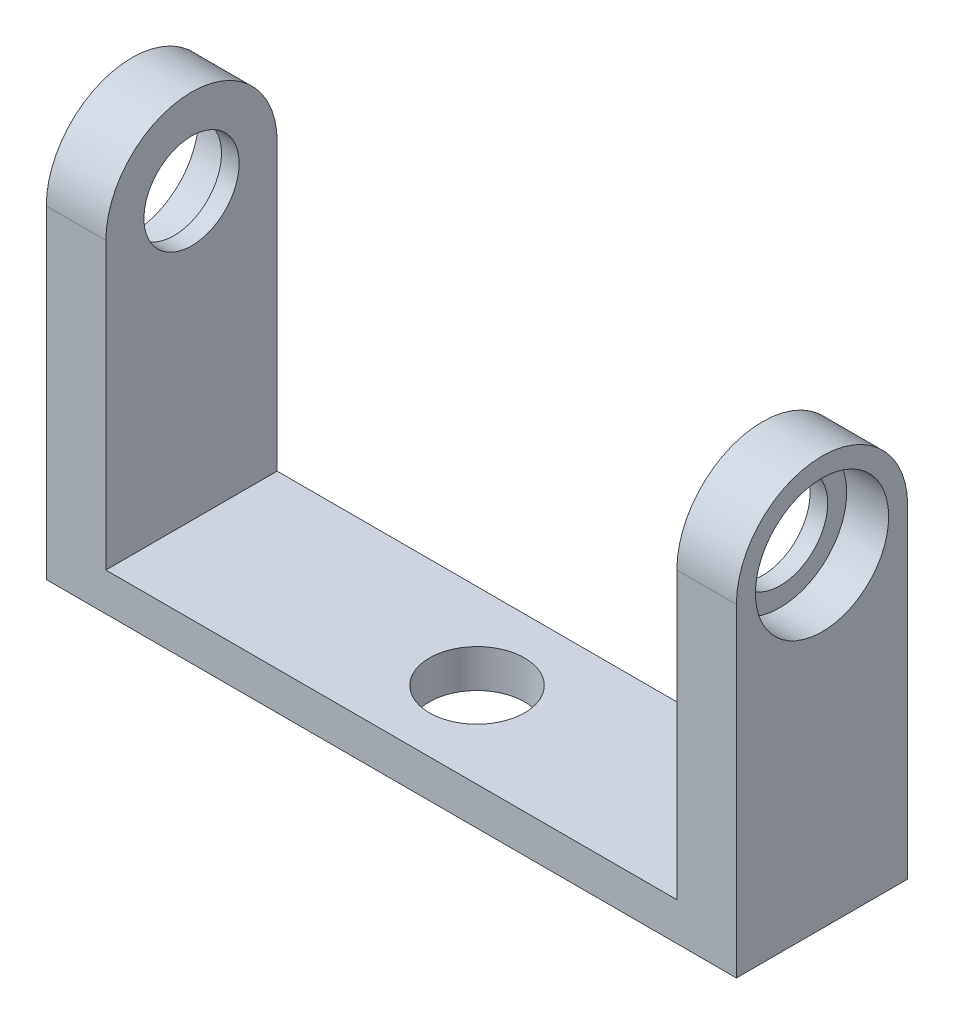
ISO-10303-21;
HEADER;
FILE_DESCRIPTION(('STEP AP214'),'2;1');
FILE_NAME('part.step','',(''),(''),'','','');
FILE_SCHEMA(('AUTOMOTIVE_DESIGN { 1 0 10303 214 1 1 1 1 }'));
ENDSEC;
DATA;
#1=APPLICATION_CONTEXT('core data for automotive mechanical design processes');
#2=APPLICATION_PROTOCOL_DEFINITION('international standard','automotive_design',2000,#1);
#3=PRODUCT_CONTEXT('',#1,'mechanical');
#4=PRODUCT('Part','Part','',(#3));
#5=PRODUCT_RELATED_PRODUCT_CATEGORY('part','',(#4));
#6=PRODUCT_DEFINITION_FORMATION('','',#4);
#7=PRODUCT_DEFINITION_CONTEXT('part definition',#1,'design');
#8=PRODUCT_DEFINITION('design','',#6,#7);
#9=PRODUCT_DEFINITION_SHAPE('','',#8);
#10=(LENGTH_UNIT() NAMED_UNIT(*) SI_UNIT(.MILLI.,.METRE.));
#11=(NAMED_UNIT(*) PLANE_ANGLE_UNIT() SI_UNIT($,.RADIAN.));
#12=(NAMED_UNIT(*) SI_UNIT($,.STERADIAN.) SOLID_ANGLE_UNIT());
#13=UNCERTAINTY_MEASURE_WITH_UNIT(LENGTH_MEASURE(1.E-05),#10,'distance_accuracy_value','');
#14=(GEOMETRIC_REPRESENTATION_CONTEXT(3) GLOBAL_UNCERTAINTY_ASSIGNED_CONTEXT((#13)) GLOBAL_UNIT_ASSIGNED_CONTEXT((#10,
#11,#12)) REPRESENTATION_CONTEXT('',''));
#15=CARTESIAN_POINT('',(0.,0.,0.));
#16=DIRECTION('',(0.,0.,1.));
#17=DIRECTION('',(1.,0.,0.));
#18=AXIS2_PLACEMENT_3D('',#15,#16,#17);
#19=CARTESIAN_POINT('',(6.26,0.,0.));
#20=DIRECTION('',(-1.,0.,0.));
#21=DIRECTION('',(0.,0.,1.));
#22=AXIS2_PLACEMENT_3D('',#19,#20,#21);
#23=CYLINDRICAL_SURFACE('',#22,5.);
#24=CARTESIAN_POINT('',(0.,0.,0.));
#25=DIRECTION('',(1.,0.,0.));
#26=DIRECTION('',(0.,0.,-1.));
#27=AXIS2_PLACEMENT_3D('',#24,#25,#26);
#28=CIRCLE('',#27,5.);
#29=CARTESIAN_POINT('',(0.,0.,-5.));
#30=VERTEX_POINT('',#29);
#31=EDGE_CURVE('E186',#30,#30,#28,.T.);
#32=ORIENTED_EDGE('',*,*,#31,.F.);
#33=EDGE_LOOP('',(#32));
#34=FACE_BOUND('',#33,.T.);
#35=CARTESIAN_POINT('',(1.85,0.,0.));
#36=DIRECTION('',(1.,0.,0.));
#37=DIRECTION('',(0.,0.,-1.));
#38=AXIS2_PLACEMENT_3D('',#35,#36,#37);
#39=CIRCLE('',#38,5.);
#40=CARTESIAN_POINT('',(1.85,0.,-5.));
#41=VERTEX_POINT('',#40);
#42=EDGE_CURVE('E37',#41,#41,#39,.T.);
#43=ORIENTED_EDGE('',*,*,#42,.T.);
#44=EDGE_LOOP('',(#43));
#45=FACE_BOUND('',#44,.T.);
#46=ADVANCED_FACE('F33',(#34,#45),#23,.F.);
#47=CARTESIAN_POINT('',(6.26,0.,0.));
#48=DIRECTION('',(1.,0.,0.));
#49=DIRECTION('',(0.,0.,-1.));
#50=AXIS2_PLACEMENT_3D('',#47,#48,#49);
#51=PLANE('',#50);
#52=CARTESIAN_POINT('',(6.26,0.,0.));
#53=DIRECTION('',(1.,0.,0.));
#54=DIRECTION('',(0.,0.,-1.));
#55=AXIS2_PLACEMENT_3D('',#52,#53,#54);
#56=CIRCLE('',#55,7.);
#57=CARTESIAN_POINT('',(6.26,0.,-7.));
#58=VERTEX_POINT('',#57);
#59=EDGE_CURVE('E169',#58,#58,#56,.T.);
#60=ORIENTED_EDGE('',*,*,#59,.F.);
#61=EDGE_LOOP('',(#60));
#62=FACE_BOUND('',#61,.T.);
#63=CARTESIAN_POINT('',(6.26,0.,0.));
#64=DIRECTION('',(1.,0.,0.));
#65=DIRECTION('',(0.,0.,-1.));
#66=AXIS2_PLACEMENT_3D('',#63,#64,#65);
#67=CIRCLE('',#66,9.);
#68=CARTESIAN_POINT('',(6.26,0.,-9.));
#69=VERTEX_POINT('',#68);
#70=CARTESIAN_POINT('',(6.26,0.,9.));
#71=VERTEX_POINT('',#70);
#72=EDGE_CURVE('E11',#69,#71,#67,.T.);
#73=ORIENTED_EDGE('',*,*,#72,.T.);
#74=DIRECTION('',(0.,1.,0.));
#75=VECTOR('',#74,1.);
#76=CARTESIAN_POINT('',(6.26,-30.,9.));
#77=LINE('',#76,#75);
#78=CARTESIAN_POINT('',(6.26,-34.,9.));
#79=VERTEX_POINT('',#78);
#80=EDGE_CURVE('E178',#79,#71,#77,.T.);
#81=ORIENTED_EDGE('',*,*,#80,.F.);
#82=DIRECTION('',(0.,0.,1.));
#83=VECTOR('',#82,1.);
#84=CARTESIAN_POINT('',(6.26,-34.,9.));
#85=LINE('',#84,#83);
#86=CARTESIAN_POINT('',(6.26,-34.,-9.));
#87=VERTEX_POINT('',#86);
#88=EDGE_CURVE('E115',#87,#79,#85,.T.);
#89=ORIENTED_EDGE('',*,*,#88,.F.);
#90=DIRECTION('',(0.,-1.,0.));
#91=VECTOR('',#90,1.);
#92=CARTESIAN_POINT('',(6.26,0.,-9.));
#93=LINE('',#92,#91);
#94=EDGE_CURVE('E71',#69,#87,#93,.T.);
#95=ORIENTED_EDGE('',*,*,#94,.F.);
#96=EDGE_LOOP('',(#73,#81,#89,#95));
#97=FACE_BOUND('',#96,.T.);
#98=ADVANCED_FACE('F199',(#62,#97),#51,.T.);
#99=CARTESIAN_POINT('',(0.,0.,0.));
#100=DIRECTION('',(1.,0.,0.));
#101=DIRECTION('',(0.,0.,-1.));
#102=AXIS2_PLACEMENT_3D('',#99,#100,#101);
#103=PLANE('',#102);
#104=DIRECTION('',(0.,1.,0.));
#105=VECTOR('',#104,1.);
#106=CARTESIAN_POINT('',(0.,-30.,9.));
#107=LINE('',#106,#105);
#108=CARTESIAN_POINT('',(0.,-30.,9.));
#109=VERTEX_POINT('',#108);
#110=CARTESIAN_POINT('',(0.,0.,9.));
#111=VERTEX_POINT('',#110);
#112=EDGE_CURVE('E179',#109,#111,#107,.T.);
#113=ORIENTED_EDGE('',*,*,#112,.T.);
#114=CARTESIAN_POINT('',(0.,0.,0.));
#115=DIRECTION('',(1.,0.,0.));
#116=DIRECTION('',(0.,0.,-1.));
#117=AXIS2_PLACEMENT_3D('',#114,#115,#116);
#118=CIRCLE('',#117,9.);
#119=CARTESIAN_POINT('',(0.,0.,-9.));
#120=VERTEX_POINT('',#119);
#121=EDGE_CURVE('E42',#120,#111,#118,.T.);
#122=ORIENTED_EDGE('',*,*,#121,.F.);
#123=DIRECTION('',(0.,-1.,0.));
#124=VECTOR('',#123,1.);
#125=CARTESIAN_POINT('',(0.,0.,-9.));
#126=LINE('',#125,#124);
#127=CARTESIAN_POINT('',(0.,-30.,-9.));
#128=VERTEX_POINT('',#127);
#129=EDGE_CURVE('E50',#120,#128,#126,.T.);
#130=ORIENTED_EDGE('',*,*,#129,.T.);
#131=DIRECTION('',(0.,0.,1.));
#132=VECTOR('',#131,1.);
#133=CARTESIAN_POINT('',(0.,-30.,-8.99999999999999));
#134=LINE('',#133,#132);
#135=EDGE_CURVE('E77',#128,#109,#134,.T.);
#136=ORIENTED_EDGE('',*,*,#135,.T.);
#137=EDGE_LOOP('',(#113,#122,#130,#136));
#138=FACE_BOUND('',#137,.T.);
#139=ORIENTED_EDGE('',*,*,#31,.T.);
#140=EDGE_LOOP('',(#139));
#141=FACE_BOUND('',#140,.T.);
#142=ADVANCED_FACE('F197',(#138,#141),#103,.F.);
#143=CARTESIAN_POINT('',(6.26,0.,0.));
#144=DIRECTION('',(-1.,0.,0.));
#145=DIRECTION('',(0.,0.,1.));
#146=AXIS2_PLACEMENT_3D('',#143,#144,#145);
#147=CYLINDRICAL_SURFACE('',#146,9.);
#148=ORIENTED_EDGE('',*,*,#121,.T.);
#149=DIRECTION('',(-1.,0.,0.));
#150=VECTOR('',#149,1.);
#151=CARTESIAN_POINT('',(41.2457113690718,0.,9.));
#152=LINE('',#151,#150);
#153=EDGE_CURVE('E184',#71,#111,#152,.T.);
#154=ORIENTED_EDGE('',*,*,#153,.F.);
#155=ORIENTED_EDGE('',*,*,#72,.F.);
#156=DIRECTION('',(-1.,0.,0.));
#157=VECTOR('',#156,1.);
#158=CARTESIAN_POINT('',(41.2457113690718,0.,-9.));
#159=LINE('',#158,#157);
#160=EDGE_CURVE('E187',#69,#120,#159,.T.);
#161=ORIENTED_EDGE('',*,*,#160,.T.);
#162=EDGE_LOOP('',(#148,#154,#155,#161));
#163=FACE_BOUND('',#162,.T.);
#164=ADVANCED_FACE('F35',(#163),#147,.T.);
#165=CARTESIAN_POINT('',(41.2457113690718,-30.,9.));
#166=DIRECTION('',(0.,0.,1.));
#167=DIRECTION('',(0.,-1.,0.));
#168=AXIS2_PLACEMENT_3D('',#165,#166,#167);
#169=PLANE('',#168);
#170=ORIENTED_EDGE('',*,*,#112,.F.);
#171=DIRECTION('',(-1.,0.,0.));
#172=VECTOR('',#171,1.);
#173=CARTESIAN_POINT('',(6.26,-30.,9.));
#174=LINE('',#173,#172);
#175=CARTESIAN_POINT('',(-60.,-30.,9.00000000000001));
#176=VERTEX_POINT('',#175);
#177=EDGE_CURVE('E59',#109,#176,#174,.T.);
#178=ORIENTED_EDGE('',*,*,#177,.T.);
#179=DIRECTION('',(0.,1.,0.));
#180=VECTOR('',#179,1.);
#181=CARTESIAN_POINT('',(-60.,-30.,9.00000000000001));
#182=LINE('',#181,#180);
#183=CARTESIAN_POINT('',(-60.,0.,9.00000000000001));
#184=VERTEX_POINT('',#183);
#185=EDGE_CURVE('E148',#176,#184,#182,.T.);
#186=ORIENTED_EDGE('',*,*,#185,.T.);
#187=DIRECTION('',(1.,0.,0.));
#188=VECTOR('',#187,1.);
#189=CARTESIAN_POINT('',(-101.245711369072,0.,9.00000000000003));
#190=LINE('',#189,#188);
#191=CARTESIAN_POINT('',(-66.26,0.,9.00000000000001));
#192=VERTEX_POINT('',#191);
#193=EDGE_CURVE('E123',#192,#184,#190,.T.);
#194=ORIENTED_EDGE('',*,*,#193,.F.);
#195=DIRECTION('',(0.,1.,0.));
#196=VECTOR('',#195,1.);
#197=CARTESIAN_POINT('',(-66.26,-30.,9.00000000000001));
#198=LINE('',#197,#196);
#199=CARTESIAN_POINT('',(-66.26,-34.,9.00000000000001));
#200=VERTEX_POINT('',#199);
#201=EDGE_CURVE('E120',#200,#192,#198,.T.);
#202=ORIENTED_EDGE('',*,*,#201,.F.);
#203=DIRECTION('',(-1.,0.,0.));
#204=VECTOR('',#203,1.);
#205=CARTESIAN_POINT('',(6.26,-34.,9.));
#206=LINE('',#205,#204);
#207=EDGE_CURVE('E108',#79,#200,#206,.T.);
#208=ORIENTED_EDGE('',*,*,#207,.F.);
#209=ORIENTED_EDGE('',*,*,#80,.T.);
#210=ORIENTED_EDGE('',*,*,#153,.T.);
#211=EDGE_LOOP('',(#170,#178,#186,#194,#202,#208,#209,#210));
#212=FACE_BOUND('',#211,.T.);
#213=ADVANCED_FACE('F121',(#212),#169,.T.);
#214=CARTESIAN_POINT('',(41.2457113690718,0.,-9.));
#215=DIRECTION('',(0.,0.,-1.));
#216=DIRECTION('',(0.,1.,0.));
#217=AXIS2_PLACEMENT_3D('',#214,#215,#216);
#218=PLANE('',#217);
#219=ORIENTED_EDGE('',*,*,#160,.F.);
#220=ORIENTED_EDGE('',*,*,#94,.T.);
#221=DIRECTION('',(1.,0.,0.));
#222=VECTOR('',#221,1.);
#223=CARTESIAN_POINT('',(6.26,-34.,-9.));
#224=LINE('',#223,#222);
#225=CARTESIAN_POINT('',(-66.26,-34.,-8.99999999999998));
#226=VERTEX_POINT('',#225);
#227=EDGE_CURVE('E117',#226,#87,#224,.T.);
#228=ORIENTED_EDGE('',*,*,#227,.F.);
#229=DIRECTION('',(0.,-1.,0.));
#230=VECTOR('',#229,1.);
#231=CARTESIAN_POINT('',(-66.26,0.,-8.99999999999999));
#232=LINE('',#231,#230);
#233=CARTESIAN_POINT('',(-66.26,0.,-8.99999999999999));
#234=VERTEX_POINT('',#233);
#235=EDGE_CURVE('E131',#234,#226,#232,.T.);
#236=ORIENTED_EDGE('',*,*,#235,.F.);
#237=DIRECTION('',(1.,0.,0.));
#238=VECTOR('',#237,1.);
#239=CARTESIAN_POINT('',(-101.245711369072,0.,-8.99999999999997));
#240=LINE('',#239,#238);
#241=CARTESIAN_POINT('',(-60.,0.,-8.99999999999999));
#242=VERTEX_POINT('',#241);
#243=EDGE_CURVE('E154',#234,#242,#240,.T.);
#244=ORIENTED_EDGE('',*,*,#243,.T.);
#245=DIRECTION('',(0.,-1.,0.));
#246=VECTOR('',#245,1.);
#247=CARTESIAN_POINT('',(-60.,0.,-8.99999999999999));
#248=LINE('',#247,#246);
#249=CARTESIAN_POINT('',(-60.,-30.,-8.99999999999998));
#250=VERTEX_POINT('',#249);
#251=EDGE_CURVE('E127',#242,#250,#248,.T.);
#252=ORIENTED_EDGE('',*,*,#251,.T.);
#253=DIRECTION('',(1.,0.,0.));
#254=VECTOR('',#253,1.);
#255=CARTESIAN_POINT('',(6.26,-30.,-9.));
#256=LINE('',#255,#254);
#257=EDGE_CURVE('E166',#250,#128,#256,.T.);
#258=ORIENTED_EDGE('',*,*,#257,.T.);
#259=ORIENTED_EDGE('',*,*,#129,.F.);
#260=EDGE_LOOP('',(#219,#220,#228,#236,#244,#252,#258,#259));
#261=FACE_BOUND('',#260,.T.);
#262=ADVANCED_FACE('F214',(#261),#218,.T.);
#263=CARTESIAN_POINT('',(1.85,0.,0.));
#264=DIRECTION('',(1.,0.,0.));
#265=DIRECTION('',(0.,0.,-1.));
#266=AXIS2_PLACEMENT_3D('',#263,#264,#265);
#267=CYLINDRICAL_SURFACE('',#266,7.);
#268=CARTESIAN_POINT('',(1.85,0.,0.));
#269=DIRECTION('',(1.,0.,0.));
#270=DIRECTION('',(0.,0.,-1.));
#271=AXIS2_PLACEMENT_3D('',#268,#269,#270);
#272=CIRCLE('',#271,7.);
#273=CARTESIAN_POINT('',(1.85,0.,-7.));
#274=VERTEX_POINT('',#273);
#275=EDGE_CURVE('E172',#274,#274,#272,.T.);
#276=ORIENTED_EDGE('',*,*,#275,.F.);
#277=EDGE_LOOP('',(#276));
#278=FACE_BOUND('',#277,.T.);
#279=ORIENTED_EDGE('',*,*,#59,.T.);
#280=EDGE_LOOP('',(#279));
#281=FACE_BOUND('',#280,.T.);
#282=ADVANCED_FACE('F217',(#278,#281),#267,.F.);
#283=CARTESIAN_POINT('',(1.85,0.,0.));
#284=DIRECTION('',(1.,0.,0.));
#285=DIRECTION('',(0.,0.,-1.));
#286=AXIS2_PLACEMENT_3D('',#283,#284,#285);
#287=PLANE('',#286);
#288=ORIENTED_EDGE('',*,*,#42,.F.);
#289=EDGE_LOOP('',(#288));
#290=FACE_BOUND('',#289,.T.);
#291=ORIENTED_EDGE('',*,*,#275,.T.);
#292=EDGE_LOOP('',(#291));
#293=FACE_BOUND('',#292,.T.);
#294=ADVANCED_FACE('F220',(#290,#293),#287,.T.);
#295=CARTESIAN_POINT('',(0.,-30.,0.));
#296=DIRECTION('',(0.,1.,0.));
#297=DIRECTION('',(0.,0.,1.));
#298=AXIS2_PLACEMENT_3D('',#295,#296,#297);
#299=PLANE('',#298);
#300=CARTESIAN_POINT('',(-30.,-30.,0.));
#301=DIRECTION('',(0.,1.,0.));
#302=DIRECTION('',(0.,0.,1.));
#303=AXIS2_PLACEMENT_3D('',#300,#301,#302);
#304=CIRCLE('',#303,5.);
#305=CARTESIAN_POINT('',(-30.,-30.,5.00000000000001));
#306=VERTEX_POINT('',#305);
#307=EDGE_CURVE('E139',#306,#306,#304,.T.);
#308=ORIENTED_EDGE('',*,*,#307,.F.);
#309=EDGE_LOOP('',(#308));
#310=FACE_BOUND('',#309,.T.);
#311=ORIENTED_EDGE('',*,*,#135,.F.);
#312=ORIENTED_EDGE('',*,*,#257,.F.);
#313=DIRECTION('',(0.,0.,1.));
#314=VECTOR('',#313,1.);
#315=CARTESIAN_POINT('',(-60.,-30.,-8.99999999999998));
#316=LINE('',#315,#314);
#317=EDGE_CURVE('E150',#250,#176,#316,.T.);
#318=ORIENTED_EDGE('',*,*,#317,.T.);
#319=ORIENTED_EDGE('',*,*,#177,.F.);
#320=EDGE_LOOP('',(#311,#312,#318,#319));
#321=FACE_BOUND('',#320,.T.);
#322=ADVANCED_FACE('F224',(#310,#321),#299,.T.);
#323=CARTESIAN_POINT('',(0.,-34.,0.));
#324=DIRECTION('',(0.,1.,0.));
#325=DIRECTION('',(0.,0.,1.));
#326=AXIS2_PLACEMENT_3D('',#323,#324,#325);
#327=PLANE('',#326);
#328=CARTESIAN_POINT('',(-30.,-34.,0.));
#329=DIRECTION('',(0.,1.,0.));
#330=DIRECTION('',(0.,0.,1.));
#331=AXIS2_PLACEMENT_3D('',#328,#329,#330);
#332=CIRCLE('',#331,5.);
#333=CARTESIAN_POINT('',(-30.,-34.,5.00000000000001));
#334=VERTEX_POINT('',#333);
#335=EDGE_CURVE('E133',#334,#334,#332,.T.);
#336=ORIENTED_EDGE('',*,*,#335,.T.);
#337=EDGE_LOOP('',(#336));
#338=FACE_BOUND('',#337,.T.);
#339=ORIENTED_EDGE('',*,*,#88,.T.);
#340=ORIENTED_EDGE('',*,*,#207,.T.);
#341=DIRECTION('',(0.,0.,1.));
#342=VECTOR('',#341,1.);
#343=CARTESIAN_POINT('',(-66.26,-34.,9.00000000000001));
#344=LINE('',#343,#342);
#345=EDGE_CURVE('E113',#226,#200,#344,.T.);
#346=ORIENTED_EDGE('',*,*,#345,.F.);
#347=ORIENTED_EDGE('',*,*,#227,.T.);
#348=EDGE_LOOP('',(#339,#340,#346,#347));
#349=FACE_BOUND('',#348,.T.);
#350=ADVANCED_FACE('F110',(#338,#349),#327,.F.);
#351=CARTESIAN_POINT('',(-66.26,0.,0.));
#352=DIRECTION('',(1.,0.,0.));
#353=DIRECTION('',(0.,0.,1.));
#354=AXIS2_PLACEMENT_3D('',#351,#352,#353);
#355=CYLINDRICAL_SURFACE('',#354,5.);
#356=CARTESIAN_POINT('',(-60.,0.,0.));
#357=DIRECTION('',(1.,0.,0.));
#358=DIRECTION('',(0.,0.,-1.));
#359=AXIS2_PLACEMENT_3D('',#356,#357,#358);
#360=CIRCLE('',#359,5.);
#361=CARTESIAN_POINT('',(-60.,0.,-4.99999999999999));
#362=VERTEX_POINT('',#361);
#363=EDGE_CURVE('E153',#362,#362,#360,.T.);
#364=ORIENTED_EDGE('',*,*,#363,.T.);
#365=EDGE_LOOP('',(#364));
#366=FACE_BOUND('',#365,.T.);
#367=CARTESIAN_POINT('',(-61.85,0.,0.));
#368=DIRECTION('',(1.,0.,0.));
#369=DIRECTION('',(0.,0.,-1.));
#370=AXIS2_PLACEMENT_3D('',#367,#368,#369);
#371=CIRCLE('',#370,5.);
#372=CARTESIAN_POINT('',(-61.85,0.,-4.99999999999999));
#373=VERTEX_POINT('',#372);
#374=EDGE_CURVE('E144',#373,#373,#371,.T.);
#375=ORIENTED_EDGE('',*,*,#374,.F.);
#376=EDGE_LOOP('',(#375));
#377=FACE_BOUND('',#376,.T.);
#378=ADVANCED_FACE('F231',(#366,#377),#355,.F.);
#379=CARTESIAN_POINT('',(-66.26,0.,0.));
#380=DIRECTION('',(-1.,0.,0.));
#381=DIRECTION('',(0.,0.,-1.));
#382=AXIS2_PLACEMENT_3D('',#379,#380,#381);
#383=PLANE('',#382);
#384=CARTESIAN_POINT('',(-66.26,0.,0.));
#385=DIRECTION('',(1.,0.,0.));
#386=DIRECTION('',(0.,0.,-1.));
#387=AXIS2_PLACEMENT_3D('',#384,#385,#386);
#388=CIRCLE('',#387,7.);
#389=CARTESIAN_POINT('',(-66.26,0.,-6.99999999999999));
#390=VERTEX_POINT('',#389);
#391=EDGE_CURVE('E132',#390,#390,#388,.T.);
#392=ORIENTED_EDGE('',*,*,#391,.T.);
#393=EDGE_LOOP('',(#392));
#394=FACE_BOUND('',#393,.T.);
#395=CARTESIAN_POINT('',(-66.26,0.,0.));
#396=DIRECTION('',(1.,0.,0.));
#397=DIRECTION('',(0.,0.,-1.));
#398=AXIS2_PLACEMENT_3D('',#395,#396,#397);
#399=CIRCLE('',#398,9.);
#400=EDGE_CURVE('E160',#234,#192,#399,.T.);
#401=ORIENTED_EDGE('',*,*,#400,.F.);
#402=ORIENTED_EDGE('',*,*,#235,.T.);
#403=ORIENTED_EDGE('',*,*,#345,.T.);
#404=ORIENTED_EDGE('',*,*,#201,.T.);
#405=EDGE_LOOP('',(#401,#402,#403,#404));
#406=FACE_BOUND('',#405,.T.);
#407=ADVANCED_FACE('F129',(#394,#406),#383,.T.);
#408=CARTESIAN_POINT('',(-60.,0.,0.));
#409=DIRECTION('',(-1.,0.,0.));
#410=DIRECTION('',(0.,0.,-1.));
#411=AXIS2_PLACEMENT_3D('',#408,#409,#410);
#412=PLANE('',#411);
#413=ORIENTED_EDGE('',*,*,#185,.F.);
#414=ORIENTED_EDGE('',*,*,#317,.F.);
#415=ORIENTED_EDGE('',*,*,#251,.F.);
#416=CARTESIAN_POINT('',(-60.,0.,0.));
#417=DIRECTION('',(1.,0.,0.));
#418=DIRECTION('',(0.,0.,-1.));
#419=AXIS2_PLACEMENT_3D('',#416,#417,#418);
#420=CIRCLE('',#419,9.);
#421=EDGE_CURVE('E159',#242,#184,#420,.T.);
#422=ORIENTED_EDGE('',*,*,#421,.T.);
#423=EDGE_LOOP('',(#413,#414,#415,#422));
#424=FACE_BOUND('',#423,.T.);
#425=ORIENTED_EDGE('',*,*,#363,.F.);
#426=EDGE_LOOP('',(#425));
#427=FACE_BOUND('',#426,.T.);
#428=ADVANCED_FACE('F237',(#424,#427),#412,.F.);
#429=CARTESIAN_POINT('',(-66.26,0.,0.));
#430=DIRECTION('',(1.,0.,0.));
#431=DIRECTION('',(0.,0.,1.));
#432=AXIS2_PLACEMENT_3D('',#429,#430,#431);
#433=CYLINDRICAL_SURFACE('',#432,9.);
#434=ORIENTED_EDGE('',*,*,#421,.F.);
#435=ORIENTED_EDGE('',*,*,#243,.F.);
#436=ORIENTED_EDGE('',*,*,#400,.T.);
#437=ORIENTED_EDGE('',*,*,#193,.T.);
#438=EDGE_LOOP('',(#434,#435,#436,#437));
#439=FACE_BOUND('',#438,.T.);
#440=ADVANCED_FACE('F233',(#439),#433,.T.);
#441=CARTESIAN_POINT('',(-61.85,0.,0.));
#442=DIRECTION('',(-1.,0.,0.));
#443=DIRECTION('',(0.,0.,-1.));
#444=AXIS2_PLACEMENT_3D('',#441,#442,#443);
#445=CYLINDRICAL_SURFACE('',#444,7.);
#446=CARTESIAN_POINT('',(-61.85,0.,0.));
#447=DIRECTION('',(1.,0.,0.));
#448=DIRECTION('',(0.,0.,-1.));
#449=AXIS2_PLACEMENT_3D('',#446,#447,#448);
#450=CIRCLE('',#449,7.);
#451=CARTESIAN_POINT('',(-61.85,0.,-6.99999999999999));
#452=VERTEX_POINT('',#451);
#453=EDGE_CURVE('E136',#452,#452,#450,.T.);
#454=ORIENTED_EDGE('',*,*,#453,.T.);
#455=EDGE_LOOP('',(#454));
#456=FACE_BOUND('',#455,.T.);
#457=ORIENTED_EDGE('',*,*,#391,.F.);
#458=EDGE_LOOP('',(#457));
#459=FACE_BOUND('',#458,.T.);
#460=ADVANCED_FACE('F236',(#456,#459),#445,.F.);
#461=CARTESIAN_POINT('',(-61.85,0.,0.));
#462=DIRECTION('',(-1.,0.,0.));
#463=DIRECTION('',(0.,0.,-1.));
#464=AXIS2_PLACEMENT_3D('',#461,#462,#463);
#465=PLANE('',#464);
#466=ORIENTED_EDGE('',*,*,#374,.T.);
#467=EDGE_LOOP('',(#466));
#468=FACE_BOUND('',#467,.T.);
#469=ORIENTED_EDGE('',*,*,#453,.F.);
#470=EDGE_LOOP('',(#469));
#471=FACE_BOUND('',#470,.T.);
#472=ADVANCED_FACE('F250',(#468,#471),#465,.T.);
#473=CARTESIAN_POINT('',(-30.,-34.,0.));
#474=DIRECTION('',(0.,1.,0.));
#475=DIRECTION('',(0.,0.,1.));
#476=AXIS2_PLACEMENT_3D('',#473,#474,#475);
#477=CYLINDRICAL_SURFACE('',#476,5.);
#478=ORIENTED_EDGE('',*,*,#335,.F.);
#479=EDGE_LOOP('',(#478));
#480=FACE_BOUND('',#479,.T.);
#481=ORIENTED_EDGE('',*,*,#307,.T.);
#482=EDGE_LOOP('',(#481));
#483=FACE_BOUND('',#482,.T.);
#484=ADVANCED_FACE('F254',(#480,#483),#477,.F.);
#485=CLOSED_SHELL('',(#46,#98,#142,#164,#213,#262,#282,#294,#322,#350,#378,#407,#428,#440,#460,
#472,#484));
#486=MANIFOLD_SOLID_BREP('B2',#485);
#487=ADVANCED_BREP_SHAPE_REPRESENTATION('',(#18,#486),#14);
#488=SHAPE_DEFINITION_REPRESENTATION(#9,#487);
ENDSEC;
END-ISO-10303-21;
